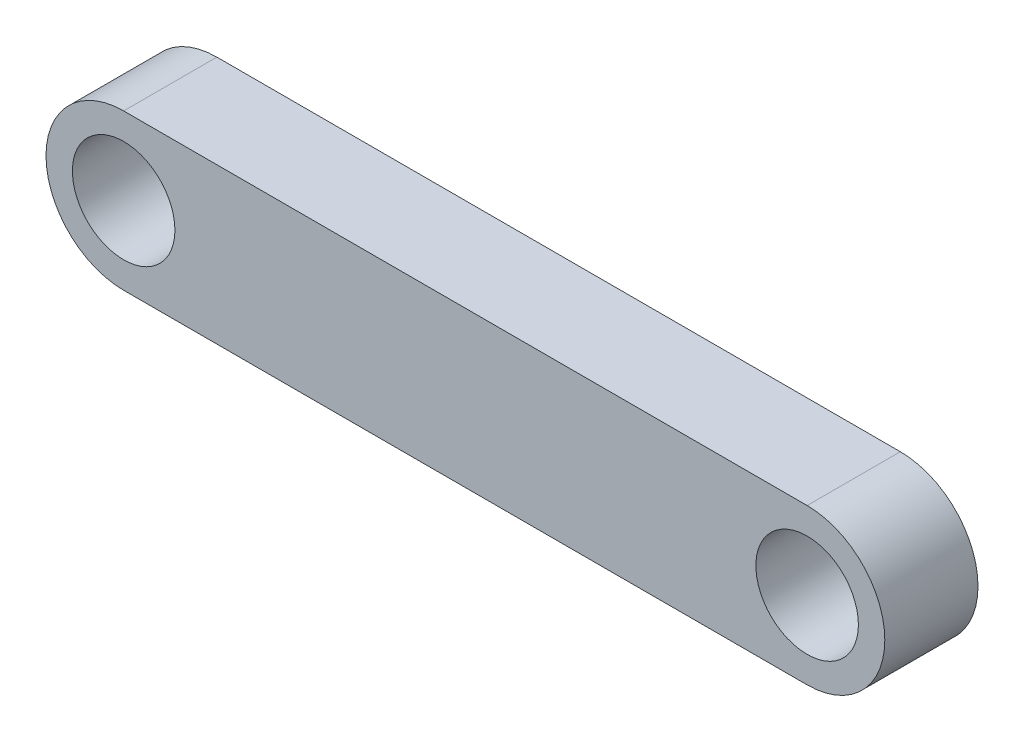
ISO-10303-21;
HEADER;
FILE_DESCRIPTION(('STEP AP214'),'2;1');
FILE_NAME('part.step','',(''),(''),'','','');
FILE_SCHEMA(('AUTOMOTIVE_DESIGN { 1 0 10303 214 1 1 1 1 }'));
ENDSEC;
DATA;
#1=APPLICATION_CONTEXT('core data for automotive mechanical design processes');
#2=APPLICATION_PROTOCOL_DEFINITION('international standard','automotive_design',2000,#1);
#3=PRODUCT_CONTEXT('',#1,'mechanical');
#4=PRODUCT('Part','Part','',(#3));
#5=PRODUCT_RELATED_PRODUCT_CATEGORY('part','',(#4));
#6=PRODUCT_DEFINITION_FORMATION('','',#4);
#7=PRODUCT_DEFINITION_CONTEXT('part definition',#1,'design');
#8=PRODUCT_DEFINITION('design','',#6,#7);
#9=PRODUCT_DEFINITION_SHAPE('','',#8);
#10=(LENGTH_UNIT() NAMED_UNIT(*) SI_UNIT(.MILLI.,.METRE.));
#11=(NAMED_UNIT(*) PLANE_ANGLE_UNIT() SI_UNIT($,.RADIAN.));
#12=(NAMED_UNIT(*) SI_UNIT($,.STERADIAN.) SOLID_ANGLE_UNIT());
#13=UNCERTAINTY_MEASURE_WITH_UNIT(LENGTH_MEASURE(1.E-05),#10,'distance_accuracy_value','');
#14=(GEOMETRIC_REPRESENTATION_CONTEXT(3) GLOBAL_UNCERTAINTY_ASSIGNED_CONTEXT((#13)) GLOBAL_UNIT_ASSIGNED_CONTEXT((#10,
#11,#12)) REPRESENTATION_CONTEXT('',''));
#15=CARTESIAN_POINT('',(0.,0.,0.));
#16=DIRECTION('',(0.,0.,1.));
#17=DIRECTION('',(1.,0.,0.));
#18=AXIS2_PLACEMENT_3D('',#15,#16,#17);
#19=CARTESIAN_POINT('',(0.,0.,3.));
#20=DIRECTION('',(0.,0.,1.));
#21=DIRECTION('',(1.,0.,0.));
#22=AXIS2_PLACEMENT_3D('',#19,#20,#21);
#23=PLANE('',#22);
#24=CARTESIAN_POINT('',(0.,0.,3.));
#25=DIRECTION('',(0.,0.,1.));
#26=DIRECTION('',(1.,0.,0.));
#27=AXIS2_PLACEMENT_3D('',#24,#25,#26);
#28=CIRCLE('',#27,1.65);
#29=CARTESIAN_POINT('',(1.65,0.,3.));
#30=VERTEX_POINT('',#29);
#31=EDGE_CURVE('E121',#30,#30,#28,.T.);
#32=ORIENTED_EDGE('',*,*,#31,.F.);
#33=EDGE_LOOP('',(#32));
#34=FACE_BOUND('',#33,.T.);
#35=CARTESIAN_POINT('',(0.,0.,3.));
#36=DIRECTION('',(0.,0.,1.));
#37=DIRECTION('',(1.,0.,0.));
#38=AXIS2_PLACEMENT_3D('',#35,#36,#37);
#39=CIRCLE('',#38,2.5);
#40=CARTESIAN_POINT('',(0.,2.5,3.));
#41=VERTEX_POINT('',#40);
#42=CARTESIAN_POINT('',(0.,-2.5,3.));
#43=VERTEX_POINT('',#42);
#44=EDGE_CURVE('E101',#41,#43,#39,.T.);
#45=ORIENTED_EDGE('',*,*,#44,.T.);
#46=DIRECTION('',(1.,0.,0.));
#47=VECTOR('',#46,1.);
#48=CARTESIAN_POINT('',(22.,-2.5,3.));
#49=LINE('',#48,#47);
#50=CARTESIAN_POINT('',(22.,-2.5,3.));
#51=VERTEX_POINT('',#50);
#52=EDGE_CURVE('E96',#43,#51,#49,.T.);
#53=ORIENTED_EDGE('',*,*,#52,.T.);
#54=CARTESIAN_POINT('',(22.,0.,3.));
#55=DIRECTION('',(0.,0.,1.));
#56=DIRECTION('',(1.,0.,0.));
#57=AXIS2_PLACEMENT_3D('',#54,#55,#56);
#58=CIRCLE('',#57,2.5);
#59=CARTESIAN_POINT('',(22.,2.5,3.));
#60=VERTEX_POINT('',#59);
#61=EDGE_CURVE('E99',#51,#60,#58,.T.);
#62=ORIENTED_EDGE('',*,*,#61,.T.);
#63=DIRECTION('',(-1.,0.,0.));
#64=VECTOR('',#63,1.);
#65=CARTESIAN_POINT('',(0.,2.5,3.));
#66=LINE('',#65,#64);
#67=EDGE_CURVE('E66',#60,#41,#66,.T.);
#68=ORIENTED_EDGE('',*,*,#67,.T.);
#69=EDGE_LOOP('',(#45,#53,#62,#68));
#70=FACE_BOUND('',#69,.T.);
#71=CARTESIAN_POINT('',(22.,0.,3.));
#72=DIRECTION('',(0.,0.,1.));
#73=DIRECTION('',(1.,0.,0.));
#74=AXIS2_PLACEMENT_3D('',#71,#72,#73);
#75=CIRCLE('',#74,1.65);
#76=CARTESIAN_POINT('',(23.65,0.,3.));
#77=VERTEX_POINT('',#76);
#78=EDGE_CURVE('E143',#77,#77,#75,.T.);
#79=ORIENTED_EDGE('',*,*,#78,.F.);
#80=EDGE_LOOP('',(#79));
#81=FACE_BOUND('',#80,.T.);
#82=ADVANCED_FACE('F48',(#34,#70,#81),#23,.T.);
#83=CARTESIAN_POINT('',(0.,0.,0.));
#84=DIRECTION('',(0.,0.,1.));
#85=DIRECTION('',(1.,0.,0.));
#86=AXIS2_PLACEMENT_3D('',#83,#84,#85);
#87=PLANE('',#86);
#88=CARTESIAN_POINT('',(0.,0.,0.));
#89=DIRECTION('',(0.,0.,1.));
#90=DIRECTION('',(1.,0.,0.));
#91=AXIS2_PLACEMENT_3D('',#88,#89,#90);
#92=CIRCLE('',#91,2.5);
#93=CARTESIAN_POINT('',(0.,2.5,0.));
#94=VERTEX_POINT('',#93);
#95=CARTESIAN_POINT('',(0.,-2.5,0.));
#96=VERTEX_POINT('',#95);
#97=EDGE_CURVE('E117',#94,#96,#92,.T.);
#98=ORIENTED_EDGE('',*,*,#97,.F.);
#99=DIRECTION('',(-1.,0.,0.));
#100=VECTOR('',#99,1.);
#101=CARTESIAN_POINT('',(0.,2.5,0.));
#102=LINE('',#101,#100);
#103=CARTESIAN_POINT('',(22.,2.5,0.));
#104=VERTEX_POINT('',#103);
#105=EDGE_CURVE('E89',#104,#94,#102,.T.);
#106=ORIENTED_EDGE('',*,*,#105,.F.);
#107=CARTESIAN_POINT('',(22.,0.,0.));
#108=DIRECTION('',(0.,0.,1.));
#109=DIRECTION('',(1.,0.,0.));
#110=AXIS2_PLACEMENT_3D('',#107,#108,#109);
#111=CIRCLE('',#110,2.5);
#112=CARTESIAN_POINT('',(22.,-2.5,0.));
#113=VERTEX_POINT('',#112);
#114=EDGE_CURVE('E83',#113,#104,#111,.T.);
#115=ORIENTED_EDGE('',*,*,#114,.F.);
#116=DIRECTION('',(1.,0.,0.));
#117=VECTOR('',#116,1.);
#118=CARTESIAN_POINT('',(22.,-2.5,0.));
#119=LINE('',#118,#117);
#120=EDGE_CURVE('E106',#96,#113,#119,.T.);
#121=ORIENTED_EDGE('',*,*,#120,.F.);
#122=EDGE_LOOP('',(#98,#106,#115,#121));
#123=FACE_BOUND('',#122,.T.);
#124=CARTESIAN_POINT('',(0.,0.,0.));
#125=DIRECTION('',(0.,0.,1.));
#126=DIRECTION('',(1.,0.,0.));
#127=AXIS2_PLACEMENT_3D('',#124,#125,#126);
#128=CIRCLE('',#127,1.65);
#129=CARTESIAN_POINT('',(1.65,0.,0.));
#130=VERTEX_POINT('',#129);
#131=EDGE_CURVE('E139',#130,#130,#128,.T.);
#132=ORIENTED_EDGE('',*,*,#131,.T.);
#133=EDGE_LOOP('',(#132));
#134=FACE_BOUND('',#133,.T.);
#135=CARTESIAN_POINT('',(22.,0.,0.));
#136=DIRECTION('',(0.,0.,1.));
#137=DIRECTION('',(1.,0.,0.));
#138=AXIS2_PLACEMENT_3D('',#135,#136,#137);
#139=CIRCLE('',#138,1.65);
#140=CARTESIAN_POINT('',(23.65,0.,0.));
#141=VERTEX_POINT('',#140);
#142=EDGE_CURVE('E147',#141,#141,#139,.T.);
#143=ORIENTED_EDGE('',*,*,#142,.T.);
#144=EDGE_LOOP('',(#143));
#145=FACE_BOUND('',#144,.T.);
#146=ADVANCED_FACE('F134',(#123,#134,#145),#87,.F.);
#147=CARTESIAN_POINT('',(0.,0.,3.));
#148=DIRECTION('',(0.,0.,-1.));
#149=DIRECTION('',(-1.,0.,0.));
#150=AXIS2_PLACEMENT_3D('',#147,#148,#149);
#151=CYLINDRICAL_SURFACE('',#150,2.5);
#152=ORIENTED_EDGE('',*,*,#97,.T.);
#153=DIRECTION('',(0.,0.,-1.));
#154=VECTOR('',#153,1.);
#155=CARTESIAN_POINT('',(0.,-2.5,3.));
#156=LINE('',#155,#154);
#157=EDGE_CURVE('E11',#43,#96,#156,.T.);
#158=ORIENTED_EDGE('',*,*,#157,.F.);
#159=ORIENTED_EDGE('',*,*,#44,.F.);
#160=DIRECTION('',(0.,0.,-1.));
#161=VECTOR('',#160,1.);
#162=CARTESIAN_POINT('',(0.,2.5,3.));
#163=LINE('',#162,#161);
#164=EDGE_CURVE('E113',#41,#94,#163,.T.);
#165=ORIENTED_EDGE('',*,*,#164,.T.);
#166=EDGE_LOOP('',(#152,#158,#159,#165));
#167=FACE_BOUND('',#166,.T.);
#168=ADVANCED_FACE('F50',(#167),#151,.T.);
#169=CARTESIAN_POINT('',(22.,-2.5,3.));
#170=DIRECTION('',(0.,1.,0.));
#171=DIRECTION('',(0.,0.,1.));
#172=AXIS2_PLACEMENT_3D('',#169,#170,#171);
#173=PLANE('',#172);
#174=ORIENTED_EDGE('',*,*,#120,.T.);
#175=DIRECTION('',(0.,0.,-1.));
#176=VECTOR('',#175,1.);
#177=CARTESIAN_POINT('',(22.,-2.5,3.));
#178=LINE('',#177,#176);
#179=EDGE_CURVE('E58',#51,#113,#178,.T.);
#180=ORIENTED_EDGE('',*,*,#179,.F.);
#181=ORIENTED_EDGE('',*,*,#52,.F.);
#182=ORIENTED_EDGE('',*,*,#157,.T.);
#183=EDGE_LOOP('',(#174,#180,#181,#182));
#184=FACE_BOUND('',#183,.T.);
#185=ADVANCED_FACE('F105',(#184),#173,.F.);
#186=CARTESIAN_POINT('',(22.,0.,3.));
#187=DIRECTION('',(0.,0.,-1.));
#188=DIRECTION('',(-1.,0.,0.));
#189=AXIS2_PLACEMENT_3D('',#186,#187,#188);
#190=CYLINDRICAL_SURFACE('',#189,2.5);
#191=ORIENTED_EDGE('',*,*,#114,.T.);
#192=DIRECTION('',(0.,0.,-1.));
#193=VECTOR('',#192,1.);
#194=CARTESIAN_POINT('',(22.,2.5,3.));
#195=LINE('',#194,#193);
#196=EDGE_CURVE('E108',#60,#104,#195,.T.);
#197=ORIENTED_EDGE('',*,*,#196,.F.);
#198=ORIENTED_EDGE('',*,*,#61,.F.);
#199=ORIENTED_EDGE('',*,*,#179,.T.);
#200=EDGE_LOOP('',(#191,#197,#198,#199));
#201=FACE_BOUND('',#200,.T.);
#202=ADVANCED_FACE('F109',(#201),#190,.T.);
#203=CARTESIAN_POINT('',(0.,2.5,3.));
#204=DIRECTION('',(0.,-1.,0.));
#205=DIRECTION('',(0.,0.,-1.));
#206=AXIS2_PLACEMENT_3D('',#203,#204,#205);
#207=PLANE('',#206);
#208=ORIENTED_EDGE('',*,*,#105,.T.);
#209=ORIENTED_EDGE('',*,*,#164,.F.);
#210=ORIENTED_EDGE('',*,*,#67,.F.);
#211=ORIENTED_EDGE('',*,*,#196,.T.);
#212=EDGE_LOOP('',(#208,#209,#210,#211));
#213=FACE_BOUND('',#212,.T.);
#214=ADVANCED_FACE('F131',(#213),#207,.F.);
#215=CARTESIAN_POINT('',(0.,0.,3.));
#216=DIRECTION('',(0.,0.,-1.));
#217=DIRECTION('',(-1.,0.,0.));
#218=AXIS2_PLACEMENT_3D('',#215,#216,#217);
#219=CYLINDRICAL_SURFACE('',#218,1.65);
#220=ORIENTED_EDGE('',*,*,#31,.T.);
#221=EDGE_LOOP('',(#220));
#222=FACE_BOUND('',#221,.T.);
#223=ORIENTED_EDGE('',*,*,#131,.F.);
#224=EDGE_LOOP('',(#223));
#225=FACE_BOUND('',#224,.T.);
#226=ADVANCED_FACE('F166',(#222,#225),#219,.F.);
#227=CARTESIAN_POINT('',(22.,0.,3.));
#228=DIRECTION('',(0.,0.,-1.));
#229=DIRECTION('',(-1.,0.,0.));
#230=AXIS2_PLACEMENT_3D('',#227,#228,#229);
#231=CYLINDRICAL_SURFACE('',#230,1.65);
#232=ORIENTED_EDGE('',*,*,#78,.T.);
#233=EDGE_LOOP('',(#232));
#234=FACE_BOUND('',#233,.T.);
#235=ORIENTED_EDGE('',*,*,#142,.F.);
#236=EDGE_LOOP('',(#235));
#237=FACE_BOUND('',#236,.T.);
#238=ADVANCED_FACE('F155',(#234,#237),#231,.F.);
#239=CLOSED_SHELL('',(#82,#146,#168,#185,#202,#214,#226,#238));
#240=MANIFOLD_SOLID_BREP('B2',#239);
#241=ADVANCED_BREP_SHAPE_REPRESENTATION('',(#18,#240),#14);
#242=SHAPE_DEFINITION_REPRESENTATION(#9,#241);
ENDSEC;
END-ISO-10303-21;
